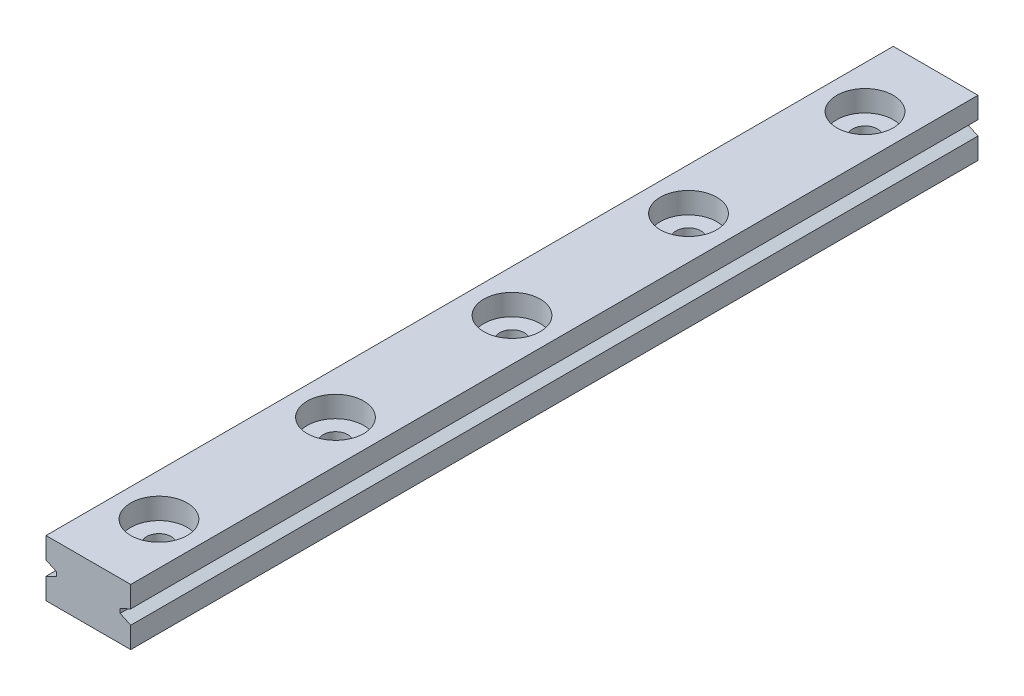
ISO-10303-21;
HEADER;
FILE_DESCRIPTION(('STEP AP214'),'2;1');
FILE_NAME('part.step','',(''),(''),'','','');
FILE_SCHEMA(('AUTOMOTIVE_DESIGN { 1 0 10303 214 1 1 1 1 }'));
ENDSEC;
DATA;
#1=APPLICATION_CONTEXT('core data for automotive mechanical design processes');
#2=APPLICATION_PROTOCOL_DEFINITION('international standard','automotive_design',2000,#1);
#3=PRODUCT_CONTEXT('',#1,'mechanical');
#4=PRODUCT('Part','Part','',(#3));
#5=PRODUCT_RELATED_PRODUCT_CATEGORY('part','',(#4));
#6=PRODUCT_DEFINITION_FORMATION('','',#4);
#7=PRODUCT_DEFINITION_CONTEXT('part definition',#1,'design');
#8=PRODUCT_DEFINITION('design','',#6,#7);
#9=PRODUCT_DEFINITION_SHAPE('','',#8);
#10=(LENGTH_UNIT() NAMED_UNIT(*) SI_UNIT(.MILLI.,.METRE.));
#11=(NAMED_UNIT(*) PLANE_ANGLE_UNIT() SI_UNIT($,.RADIAN.));
#12=(NAMED_UNIT(*) SI_UNIT($,.STERADIAN.) SOLID_ANGLE_UNIT());
#13=UNCERTAINTY_MEASURE_WITH_UNIT(LENGTH_MEASURE(1.E-05),#10,'distance_accuracy_value','');
#14=(GEOMETRIC_REPRESENTATION_CONTEXT(3) GLOBAL_UNCERTAINTY_ASSIGNED_CONTEXT((#13)) GLOBAL_UNIT_ASSIGNED_CONTEXT((#10,
#11,#12)) REPRESENTATION_CONTEXT('',''));
#15=CARTESIAN_POINT('',(0.,0.,0.));
#16=DIRECTION('',(0.,0.,1.));
#17=DIRECTION('',(1.,0.,0.));
#18=AXIS2_PLACEMENT_3D('',#15,#16,#17);
#19=CARTESIAN_POINT('',(6.,4.,120.));
#20=DIRECTION('',(-1.,0.,0.));
#21=DIRECTION('',(0.,-1.,0.));
#22=AXIS2_PLACEMENT_3D('',#19,#20,#21);
#23=PLANE('',#22);
#24=DIRECTION('',(0.,1.,0.));
#25=VECTOR('',#24,1.);
#26=CARTESIAN_POINT('',(6.,4.,120.));
#27=LINE('',#26,#25);
#28=CARTESIAN_POINT('',(6.,1.,120.));
#29=VERTEX_POINT('',#28);
#30=CARTESIAN_POINT('',(6.,4.,120.));
#31=VERTEX_POINT('',#30);
#32=EDGE_CURVE('E168',#29,#31,#27,.T.);
#33=ORIENTED_EDGE('',*,*,#32,.F.);
#34=DIRECTION('',(0.,0.,-1.));
#35=VECTOR('',#34,1.);
#36=CARTESIAN_POINT('',(6.,1.,120.));
#37=LINE('',#36,#35);
#38=CARTESIAN_POINT('',(6.,1.,0.));
#39=VERTEX_POINT('',#38);
#40=EDGE_CURVE('E217',#29,#39,#37,.T.);
#41=ORIENTED_EDGE('',*,*,#40,.T.);
#42=DIRECTION('',(0.,1.,0.));
#43=VECTOR('',#42,1.);
#44=CARTESIAN_POINT('',(6.,4.,0.));
#45=LINE('',#44,#43);
#46=CARTESIAN_POINT('',(6.,4.,0.));
#47=VERTEX_POINT('',#46);
#48=EDGE_CURVE('E162',#39,#47,#45,.T.);
#49=ORIENTED_EDGE('',*,*,#48,.T.);
#50=DIRECTION('',(0.,0.,-1.));
#51=VECTOR('',#50,1.);
#52=CARTESIAN_POINT('',(6.,4.,120.));
#53=LINE('',#52,#51);
#54=EDGE_CURVE('E11',#31,#47,#53,.T.);
#55=ORIENTED_EDGE('',*,*,#54,.F.);
#56=EDGE_LOOP('',(#33,#41,#49,#55));
#57=FACE_BOUND('',#56,.T.);
#58=ADVANCED_FACE('F34',(#57),#23,.F.);
#59=CARTESIAN_POINT('',(-6.,4.,120.));
#60=DIRECTION('',(1.,0.,0.));
#61=DIRECTION('',(0.,1.,0.));
#62=AXIS2_PLACEMENT_3D('',#59,#60,#61);
#63=PLANE('',#62);
#64=DIRECTION('',(0.,-1.,0.));
#65=VECTOR('',#64,1.);
#66=CARTESIAN_POINT('',(-6.,4.,120.));
#67=LINE('',#66,#65);
#68=CARTESIAN_POINT('',(-6.,-1.,120.));
#69=VERTEX_POINT('',#68);
#70=CARTESIAN_POINT('',(-6.,-4.,120.));
#71=VERTEX_POINT('',#70);
#72=EDGE_CURVE('E151',#69,#71,#67,.T.);
#73=ORIENTED_EDGE('',*,*,#72,.F.);
#74=DIRECTION('',(0.,0.,-1.));
#75=VECTOR('',#74,1.);
#76=CARTESIAN_POINT('',(-6.,-1.,120.));
#77=LINE('',#76,#75);
#78=CARTESIAN_POINT('',(-6.,-1.,0.));
#79=VERTEX_POINT('',#78);
#80=EDGE_CURVE('E236',#69,#79,#77,.T.);
#81=ORIENTED_EDGE('',*,*,#80,.T.);
#82=DIRECTION('',(0.,-1.,0.));
#83=VECTOR('',#82,1.);
#84=CARTESIAN_POINT('',(-6.,4.,0.));
#85=LINE('',#84,#83);
#86=CARTESIAN_POINT('',(-6.,-4.,0.));
#87=VERTEX_POINT('',#86);
#88=EDGE_CURVE('E164',#79,#87,#85,.T.);
#89=ORIENTED_EDGE('',*,*,#88,.T.);
#90=DIRECTION('',(0.,0.,-1.));
#91=VECTOR('',#90,1.);
#92=CARTESIAN_POINT('',(-6.,-4.,120.));
#93=LINE('',#92,#91);
#94=EDGE_CURVE('E171',#71,#87,#93,.T.);
#95=ORIENTED_EDGE('',*,*,#94,.F.);
#96=EDGE_LOOP('',(#73,#81,#89,#95));
#97=FACE_BOUND('',#96,.T.);
#98=ADVANCED_FACE('F323',(#97),#63,.F.);
#99=CARTESIAN_POINT('',(1.04866904845209E-12,-4.,110.));
#100=DIRECTION('',(0.,1.,0.));
#101=DIRECTION('',(0.,0.,1.));
#102=AXIS2_PLACEMENT_3D('',#99,#100,#101);
#103=CYLINDRICAL_SURFACE('',#102,1.75);
#104=CARTESIAN_POINT('',(1.04866904845209E-12,-4.,110.));
#105=DIRECTION('',(0.,1.,0.));
#106=DIRECTION('',(0.,0.,1.));
#107=AXIS2_PLACEMENT_3D('',#104,#105,#106);
#108=CIRCLE('',#107,1.75);
#109=CARTESIAN_POINT('',(1.04866904845209E-12,-4.,111.75));
#110=VERTEX_POINT('',#109);
#111=EDGE_CURVE('E189',#110,#110,#108,.T.);
#112=ORIENTED_EDGE('',*,*,#111,.F.);
#113=EDGE_LOOP('',(#112));
#114=FACE_BOUND('',#113,.T.);
#115=CARTESIAN_POINT('',(1.04866904845209E-12,1.,110.));
#116=DIRECTION('',(0.,1.,0.));
#117=DIRECTION('',(0.,0.,1.));
#118=AXIS2_PLACEMENT_3D('',#115,#116,#117);
#119=CIRCLE('',#118,1.75);
#120=CARTESIAN_POINT('',(1.04866904845209E-12,1.,111.75));
#121=VERTEX_POINT('',#120);
#122=EDGE_CURVE('E38',#121,#121,#119,.F.);
#123=ORIENTED_EDGE('',*,*,#122,.F.);
#124=EDGE_LOOP('',(#123));
#125=FACE_BOUND('',#124,.T.);
#126=ADVANCED_FACE('F327',(#114,#125),#103,.F.);
#127=CARTESIAN_POINT('',(7.86807948038852E-13,-4.,85.));
#128=DIRECTION('',(0.,1.,0.));
#129=DIRECTION('',(0.,0.,1.));
#130=AXIS2_PLACEMENT_3D('',#127,#128,#129);
#131=CYLINDRICAL_SURFACE('',#130,1.75);
#132=CARTESIAN_POINT('',(7.86807948038852E-13,-4.,85.));
#133=DIRECTION('',(0.,1.,0.));
#134=DIRECTION('',(0.,0.,1.));
#135=AXIS2_PLACEMENT_3D('',#132,#133,#134);
#136=CIRCLE('',#135,1.75);
#137=CARTESIAN_POINT('',(7.86807948038852E-13,-4.,86.75));
#138=VERTEX_POINT('',#137);
#139=EDGE_CURVE('E193',#138,#138,#136,.T.);
#140=ORIENTED_EDGE('',*,*,#139,.F.);
#141=EDGE_LOOP('',(#140));
#142=FACE_BOUND('',#141,.T.);
#143=CARTESIAN_POINT('',(7.86807948038852E-13,1.,85.));
#144=DIRECTION('',(0.,1.,0.));
#145=DIRECTION('',(0.,0.,1.));
#146=AXIS2_PLACEMENT_3D('',#143,#144,#145);
#147=CIRCLE('',#146,1.75);
#148=CARTESIAN_POINT('',(7.86807948038852E-13,1.,86.75));
#149=VERTEX_POINT('',#148);
#150=EDGE_CURVE('E184',#149,#149,#147,.F.);
#151=ORIENTED_EDGE('',*,*,#150,.F.);
#152=EDGE_LOOP('',(#151));
#153=FACE_BOUND('',#152,.T.);
#154=ADVANCED_FACE('F301',(#142,#153),#131,.F.);
#155=CARTESIAN_POINT('',(5.24946847625617E-13,-4.,60.));
#156=DIRECTION('',(0.,1.,0.));
#157=DIRECTION('',(0.,0.,1.));
#158=AXIS2_PLACEMENT_3D('',#155,#156,#157);
#159=CYLINDRICAL_SURFACE('',#158,1.75);
#160=CARTESIAN_POINT('',(5.24946847625617E-13,-4.,60.));
#161=DIRECTION('',(0.,1.,0.));
#162=DIRECTION('',(0.,0.,1.));
#163=AXIS2_PLACEMENT_3D('',#160,#161,#162);
#164=CIRCLE('',#163,1.75);
#165=CARTESIAN_POINT('',(5.24946847625617E-13,-4.,61.75));
#166=VERTEX_POINT('',#165);
#167=EDGE_CURVE('E198',#166,#166,#164,.T.);
#168=ORIENTED_EDGE('',*,*,#167,.F.);
#169=EDGE_LOOP('',(#168));
#170=FACE_BOUND('',#169,.T.);
#171=CARTESIAN_POINT('',(5.24946847625617E-13,1.,60.));
#172=DIRECTION('',(0.,1.,0.));
#173=DIRECTION('',(0.,0.,1.));
#174=AXIS2_PLACEMENT_3D('',#171,#172,#173);
#175=CIRCLE('',#174,1.75);
#176=CARTESIAN_POINT('',(5.24946847625617E-13,1.,61.75));
#177=VERTEX_POINT('',#176);
#178=EDGE_CURVE('E182',#177,#177,#175,.F.);
#179=ORIENTED_EDGE('',*,*,#178,.F.);
#180=EDGE_LOOP('',(#179));
#181=FACE_BOUND('',#180,.T.);
#182=ADVANCED_FACE('F297',(#170,#181),#159,.F.);
#183=CARTESIAN_POINT('',(2.63085747212382E-13,-4.,35.));
#184=DIRECTION('',(0.,1.,0.));
#185=DIRECTION('',(0.,0.,1.));
#186=AXIS2_PLACEMENT_3D('',#183,#184,#185);
#187=CYLINDRICAL_SURFACE('',#186,1.75);
#188=CARTESIAN_POINT('',(2.63085747212382E-13,-4.,35.));
#189=DIRECTION('',(0.,1.,0.));
#190=DIRECTION('',(0.,0.,1.));
#191=AXIS2_PLACEMENT_3D('',#188,#189,#190);
#192=CIRCLE('',#191,1.75);
#193=CARTESIAN_POINT('',(2.63085747212382E-13,-4.,36.75));
#194=VERTEX_POINT('',#193);
#195=EDGE_CURVE('E289',#194,#194,#192,.T.);
#196=ORIENTED_EDGE('',*,*,#195,.F.);
#197=EDGE_LOOP('',(#196));
#198=FACE_BOUND('',#197,.T.);
#199=CARTESIAN_POINT('',(2.63085747212382E-13,1.,35.));
#200=DIRECTION('',(0.,1.,0.));
#201=DIRECTION('',(0.,0.,1.));
#202=AXIS2_PLACEMENT_3D('',#199,#200,#201);
#203=CIRCLE('',#202,1.75);
#204=CARTESIAN_POINT('',(2.63085747212382E-13,1.,36.75));
#205=VERTEX_POINT('',#204);
#206=EDGE_CURVE('E178',#205,#205,#203,.F.);
#207=ORIENTED_EDGE('',*,*,#206,.F.);
#208=EDGE_LOOP('',(#207));
#209=FACE_BOUND('',#208,.T.);
#210=ADVANCED_FACE('F300',(#198,#209),#187,.F.);
#211=CARTESIAN_POINT('',(0.,-4.,10.));
#212=DIRECTION('',(0.,1.,0.));
#213=DIRECTION('',(0.,0.,1.));
#214=AXIS2_PLACEMENT_3D('',#211,#212,#213);
#215=CYLINDRICAL_SURFACE('',#214,1.75);
#216=CARTESIAN_POINT('',(0.,-4.,10.));
#217=DIRECTION('',(0.,1.,0.));
#218=DIRECTION('',(0.,0.,1.));
#219=AXIS2_PLACEMENT_3D('',#216,#217,#218);
#220=CIRCLE('',#219,1.75);
#221=CARTESIAN_POINT('',(0.,-4.,11.75));
#222=VERTEX_POINT('',#221);
#223=EDGE_CURVE('E220',#222,#222,#220,.T.);
#224=ORIENTED_EDGE('',*,*,#223,.F.);
#225=EDGE_LOOP('',(#224));
#226=FACE_BOUND('',#225,.T.);
#227=CARTESIAN_POINT('',(0.,1.,10.));
#228=DIRECTION('',(0.,1.,0.));
#229=DIRECTION('',(0.,0.,1.));
#230=AXIS2_PLACEMENT_3D('',#227,#228,#229);
#231=CIRCLE('',#230,1.75);
#232=CARTESIAN_POINT('',(0.,1.,11.75));
#233=VERTEX_POINT('',#232);
#234=EDGE_CURVE('E175',#233,#233,#231,.F.);
#235=ORIENTED_EDGE('',*,*,#234,.F.);
#236=EDGE_LOOP('',(#235));
#237=FACE_BOUND('',#236,.T.);
#238=ADVANCED_FACE('F331',(#226,#237),#215,.F.);
#239=CARTESIAN_POINT('',(6.,-4.,0.));
#240=VERTEX_POINT('',#239);
#241=CARTESIAN_POINT('',(6.,-1.,0.));
#242=VERTEX_POINT('',#241);
#243=EDGE_CURVE('E158',#240,#242,#45,.T.);
#244=ORIENTED_EDGE('',*,*,#243,.T.);
#245=DIRECTION('',(0.,0.,-1.));
#246=VECTOR('',#245,1.);
#247=CARTESIAN_POINT('',(6.,-1.,120.));
#248=LINE('',#247,#246);
#249=CARTESIAN_POINT('',(6.,-1.,120.));
#250=VERTEX_POINT('',#249);
#251=EDGE_CURVE('E59',#250,#242,#248,.T.);
#252=ORIENTED_EDGE('',*,*,#251,.F.);
#253=CARTESIAN_POINT('',(6.,-4.,120.));
#254=VERTEX_POINT('',#253);
#255=EDGE_CURVE('E201',#254,#250,#27,.T.);
#256=ORIENTED_EDGE('',*,*,#255,.F.);
#257=DIRECTION('',(0.,0.,-1.));
#258=VECTOR('',#257,1.);
#259=CARTESIAN_POINT('',(6.,-4.,120.));
#260=LINE('',#259,#258);
#261=EDGE_CURVE('E153',#254,#240,#260,.T.);
#262=ORIENTED_EDGE('',*,*,#261,.T.);
#263=EDGE_LOOP('',(#244,#252,#256,#262));
#264=FACE_BOUND('',#263,.T.);
#265=ADVANCED_FACE('F36',(#264),#23,.F.);
#266=CARTESIAN_POINT('',(-6.,4.,120.));
#267=DIRECTION('',(0.,-1.,0.));
#268=DIRECTION('',(0.,0.,-1.));
#269=AXIS2_PLACEMENT_3D('',#266,#267,#268);
#270=PLANE('',#269);
#271=CARTESIAN_POINT('',(0.,4.,10.));
#272=DIRECTION('',(0.,1.,0.));
#273=DIRECTION('',(0.,0.,1.));
#274=AXIS2_PLACEMENT_3D('',#271,#272,#273);
#275=CIRCLE('',#274,4.);
#276=CARTESIAN_POINT('',(0.,4.,14.));
#277=VERTEX_POINT('',#276);
#278=EDGE_CURVE('E261',#277,#277,#275,.T.);
#279=ORIENTED_EDGE('',*,*,#278,.F.);
#280=EDGE_LOOP('',(#279));
#281=FACE_BOUND('',#280,.T.);
#282=CARTESIAN_POINT('',(1.04866904845209E-12,4.,110.));
#283=DIRECTION('',(0.,1.,0.));
#284=DIRECTION('',(0.,0.,1.));
#285=AXIS2_PLACEMENT_3D('',#282,#283,#284);
#286=CIRCLE('',#285,4.);
#287=CARTESIAN_POINT('',(1.04866904845209E-12,4.,114.));
#288=VERTEX_POINT('',#287);
#289=EDGE_CURVE('E239',#288,#288,#286,.T.);
#290=ORIENTED_EDGE('',*,*,#289,.F.);
#291=EDGE_LOOP('',(#290));
#292=FACE_BOUND('',#291,.T.);
#293=CARTESIAN_POINT('',(2.63085747212382E-13,4.,35.));
#294=DIRECTION('',(0.,1.,0.));
#295=DIRECTION('',(0.,0.,1.));
#296=AXIS2_PLACEMENT_3D('',#293,#294,#295);
#297=CIRCLE('',#296,4.);
#298=CARTESIAN_POINT('',(2.63085747212382E-13,4.,39.));
#299=VERTEX_POINT('',#298);
#300=EDGE_CURVE('E274',#299,#299,#297,.T.);
#301=ORIENTED_EDGE('',*,*,#300,.F.);
#302=EDGE_LOOP('',(#301));
#303=FACE_BOUND('',#302,.T.);
#304=CARTESIAN_POINT('',(5.24946847625617E-13,4.,60.));
#305=DIRECTION('',(0.,1.,0.));
#306=DIRECTION('',(0.,0.,1.));
#307=AXIS2_PLACEMENT_3D('',#304,#305,#306);
#308=CIRCLE('',#307,4.);
#309=CARTESIAN_POINT('',(5.24946847625617E-13,4.,64.));
#310=VERTEX_POINT('',#309);
#311=EDGE_CURVE('E275',#310,#310,#308,.T.);
#312=ORIENTED_EDGE('',*,*,#311,.F.);
#313=EDGE_LOOP('',(#312));
#314=FACE_BOUND('',#313,.T.);
#315=CARTESIAN_POINT('',(7.86807948038852E-13,4.,85.));
#316=DIRECTION('',(0.,1.,0.));
#317=DIRECTION('',(0.,0.,1.));
#318=AXIS2_PLACEMENT_3D('',#315,#316,#317);
#319=CIRCLE('',#318,4.);
#320=CARTESIAN_POINT('',(7.86807948038852E-13,4.,89.));
#321=VERTEX_POINT('',#320);
#322=EDGE_CURVE('E268',#321,#321,#319,.T.);
#323=ORIENTED_EDGE('',*,*,#322,.F.);
#324=EDGE_LOOP('',(#323));
#325=FACE_BOUND('',#324,.T.);
#326=DIRECTION('',(-1.,0.,0.));
#327=VECTOR('',#326,1.);
#328=CARTESIAN_POINT('',(-6.,4.,0.));
#329=LINE('',#328,#327);
#330=CARTESIAN_POINT('',(-6.,4.,0.));
#331=VERTEX_POINT('',#330);
#332=EDGE_CURVE('E161',#47,#331,#329,.T.);
#333=ORIENTED_EDGE('',*,*,#332,.T.);
#334=DIRECTION('',(0.,0.,-1.));
#335=VECTOR('',#334,1.);
#336=CARTESIAN_POINT('',(-6.,4.,120.));
#337=LINE('',#336,#335);
#338=CARTESIAN_POINT('',(-6.,4.,120.));
#339=VERTEX_POINT('',#338);
#340=EDGE_CURVE('E43',#339,#331,#337,.T.);
#341=ORIENTED_EDGE('',*,*,#340,.F.);
#342=DIRECTION('',(-1.,0.,0.));
#343=VECTOR('',#342,1.);
#344=CARTESIAN_POINT('',(-6.,4.,120.));
#345=LINE('',#344,#343);
#346=EDGE_CURVE('E148',#31,#339,#345,.T.);
#347=ORIENTED_EDGE('',*,*,#346,.F.);
#348=ORIENTED_EDGE('',*,*,#54,.T.);
#349=EDGE_LOOP('',(#333,#341,#347,#348));
#350=FACE_BOUND('',#349,.T.);
#351=ADVANCED_FACE('F214',(#281,#292,#303,#314,#325,#350),#270,.F.);
#352=CARTESIAN_POINT('',(-6.,1.,0.));
#353=VERTEX_POINT('',#352);
#354=EDGE_CURVE('E142',#331,#353,#85,.T.);
#355=ORIENTED_EDGE('',*,*,#354,.T.);
#356=DIRECTION('',(0.,0.,-1.));
#357=VECTOR('',#356,1.);
#358=CARTESIAN_POINT('',(-6.,1.,120.));
#359=LINE('',#358,#357);
#360=CARTESIAN_POINT('',(-6.,1.,120.));
#361=VERTEX_POINT('',#360);
#362=EDGE_CURVE('E51',#361,#353,#359,.T.);
#363=ORIENTED_EDGE('',*,*,#362,.F.);
#364=EDGE_CURVE('E140',#339,#361,#67,.T.);
#365=ORIENTED_EDGE('',*,*,#364,.F.);
#366=ORIENTED_EDGE('',*,*,#340,.T.);
#367=EDGE_LOOP('',(#355,#363,#365,#366));
#368=FACE_BOUND('',#367,.T.);
#369=ADVANCED_FACE('F138',(#368),#63,.F.);
#370=CARTESIAN_POINT('',(-6.,-4.,120.));
#371=DIRECTION('',(0.,1.,0.));
#372=DIRECTION('',(0.,0.,1.));
#373=AXIS2_PLACEMENT_3D('',#370,#371,#372);
#374=PLANE('',#373);
#375=ORIENTED_EDGE('',*,*,#223,.T.);
#376=EDGE_LOOP('',(#375));
#377=FACE_BOUND('',#376,.T.);
#378=ORIENTED_EDGE('',*,*,#195,.T.);
#379=EDGE_LOOP('',(#378));
#380=FACE_BOUND('',#379,.T.);
#381=ORIENTED_EDGE('',*,*,#167,.T.);
#382=EDGE_LOOP('',(#381));
#383=FACE_BOUND('',#382,.T.);
#384=ORIENTED_EDGE('',*,*,#139,.T.);
#385=EDGE_LOOP('',(#384));
#386=FACE_BOUND('',#385,.T.);
#387=ORIENTED_EDGE('',*,*,#111,.T.);
#388=EDGE_LOOP('',(#387));
#389=FACE_BOUND('',#388,.T.);
#390=DIRECTION('',(1.,0.,0.));
#391=VECTOR('',#390,1.);
#392=CARTESIAN_POINT('',(-6.,-4.,0.));
#393=LINE('',#392,#391);
#394=EDGE_CURVE('E166',#87,#240,#393,.T.);
#395=ORIENTED_EDGE('',*,*,#394,.T.);
#396=ORIENTED_EDGE('',*,*,#261,.F.);
#397=DIRECTION('',(1.,0.,0.));
#398=VECTOR('',#397,1.);
#399=CARTESIAN_POINT('',(-6.,-4.,120.));
#400=LINE('',#399,#398);
#401=EDGE_CURVE('E150',#71,#254,#400,.T.);
#402=ORIENTED_EDGE('',*,*,#401,.F.);
#403=ORIENTED_EDGE('',*,*,#94,.T.);
#404=EDGE_LOOP('',(#395,#396,#402,#403));
#405=FACE_BOUND('',#404,.T.);
#406=ADVANCED_FACE('F294',(#377,#380,#383,#386,#389,#405),#374,.F.);
#407=CARTESIAN_POINT('',(0.,0.,120.));
#408=DIRECTION('',(0.,0.,1.));
#409=DIRECTION('',(1.,0.,0.));
#410=AXIS2_PLACEMENT_3D('',#407,#408,#409);
#411=PLANE('',#410);
#412=DIRECTION('',(-0.906183139995265,-0.422885465331124,0.));
#413=VECTOR('',#412,1.);
#414=CARTESIAN_POINT('',(-4.5,-0.3,120.));
#415=LINE('',#414,#413);
#416=CARTESIAN_POINT('',(-4.5,-0.3,120.));
#417=VERTEX_POINT('',#416);
#418=EDGE_CURVE('E143',#417,#69,#415,.T.);
#419=ORIENTED_EDGE('',*,*,#418,.T.);
#420=ORIENTED_EDGE('',*,*,#72,.T.);
#421=ORIENTED_EDGE('',*,*,#401,.T.);
#422=ORIENTED_EDGE('',*,*,#255,.T.);
#423=DIRECTION('',(-0.906183139995265,0.422885465331124,0.));
#424=VECTOR('',#423,1.);
#425=CARTESIAN_POINT('',(4.5,-0.300000000000001,120.));
#426=LINE('',#425,#424);
#427=CARTESIAN_POINT('',(4.5,-0.300000000000001,120.));
#428=VERTEX_POINT('',#427);
#429=EDGE_CURVE('E243',#250,#428,#426,.T.);
#430=ORIENTED_EDGE('',*,*,#429,.T.);
#431=DIRECTION('',(0.,1.,0.));
#432=VECTOR('',#431,1.);
#433=CARTESIAN_POINT('',(4.5,0.300000000000001,120.));
#434=LINE('',#433,#432);
#435=CARTESIAN_POINT('',(4.5,0.300000000000001,120.));
#436=VERTEX_POINT('',#435);
#437=EDGE_CURVE('E245',#428,#436,#434,.T.);
#438=ORIENTED_EDGE('',*,*,#437,.T.);
#439=DIRECTION('',(0.906183139995265,0.422885465331124,0.));
#440=VECTOR('',#439,1.);
#441=CARTESIAN_POINT('',(6.,1.,120.));
#442=LINE('',#441,#440);
#443=EDGE_CURVE('E209',#436,#29,#442,.T.);
#444=ORIENTED_EDGE('',*,*,#443,.T.);
#445=ORIENTED_EDGE('',*,*,#32,.T.);
#446=ORIENTED_EDGE('',*,*,#346,.T.);
#447=ORIENTED_EDGE('',*,*,#364,.T.);
#448=DIRECTION('',(0.906183139995265,-0.422885465331124,0.));
#449=VECTOR('',#448,1.);
#450=CARTESIAN_POINT('',(-6.,1.,120.));
#451=LINE('',#450,#449);
#452=CARTESIAN_POINT('',(-4.5,0.3,120.));
#453=VERTEX_POINT('',#452);
#454=EDGE_CURVE('E125',#361,#453,#451,.T.);
#455=ORIENTED_EDGE('',*,*,#454,.T.);
#456=DIRECTION('',(0.,-1.,0.));
#457=VECTOR('',#456,1.);
#458=CARTESIAN_POINT('',(-4.5,0.3,120.));
#459=LINE('',#458,#457);
#460=EDGE_CURVE('E132',#453,#417,#459,.T.);
#461=ORIENTED_EDGE('',*,*,#460,.T.);
#462=EDGE_LOOP('',(#419,#420,#421,#422,#430,#438,#444,#445,#446,#447,#455,#461));
#463=FACE_BOUND('',#462,.T.);
#464=ADVANCED_FACE('F146',(#463),#411,.T.);
#465=CARTESIAN_POINT('',(0.,0.,0.));
#466=DIRECTION('',(0.,0.,1.));
#467=DIRECTION('',(1.,0.,0.));
#468=AXIS2_PLACEMENT_3D('',#465,#466,#467);
#469=PLANE('',#468);
#470=ORIENTED_EDGE('',*,*,#88,.F.);
#471=DIRECTION('',(-0.906183139995265,-0.422885465331124,0.));
#472=VECTOR('',#471,1.);
#473=CARTESIAN_POINT('',(-4.5,-0.3,0.));
#474=LINE('',#473,#472);
#475=CARTESIAN_POINT('',(-4.5,-0.3,0.));
#476=VERTEX_POINT('',#475);
#477=EDGE_CURVE('E133',#476,#79,#474,.T.);
#478=ORIENTED_EDGE('',*,*,#477,.F.);
#479=DIRECTION('',(0.,-1.,0.));
#480=VECTOR('',#479,1.);
#481=CARTESIAN_POINT('',(-4.5,0.3,0.));
#482=LINE('',#481,#480);
#483=CARTESIAN_POINT('',(-4.5,0.3,0.));
#484=VERTEX_POINT('',#483);
#485=EDGE_CURVE('E227',#484,#476,#482,.T.);
#486=ORIENTED_EDGE('',*,*,#485,.F.);
#487=DIRECTION('',(0.906183139995265,-0.422885465331124,0.));
#488=VECTOR('',#487,1.);
#489=CARTESIAN_POINT('',(-6.,1.,0.));
#490=LINE('',#489,#488);
#491=EDGE_CURVE('E224',#353,#484,#490,.T.);
#492=ORIENTED_EDGE('',*,*,#491,.F.);
#493=ORIENTED_EDGE('',*,*,#354,.F.);
#494=ORIENTED_EDGE('',*,*,#332,.F.);
#495=ORIENTED_EDGE('',*,*,#48,.F.);
#496=DIRECTION('',(0.906183139995265,0.422885465331124,0.));
#497=VECTOR('',#496,1.);
#498=CARTESIAN_POINT('',(6.,1.,0.));
#499=LINE('',#498,#497);
#500=CARTESIAN_POINT('',(4.5,0.300000000000001,0.));
#501=VERTEX_POINT('',#500);
#502=EDGE_CURVE('E246',#501,#39,#499,.T.);
#503=ORIENTED_EDGE('',*,*,#502,.F.);
#504=DIRECTION('',(0.,1.,0.));
#505=VECTOR('',#504,1.);
#506=CARTESIAN_POINT('',(4.5,0.300000000000001,0.));
#507=LINE('',#506,#505);
#508=CARTESIAN_POINT('',(4.5,-0.300000000000001,0.));
#509=VERTEX_POINT('',#508);
#510=EDGE_CURVE('E251',#509,#501,#507,.T.);
#511=ORIENTED_EDGE('',*,*,#510,.F.);
#512=DIRECTION('',(-0.906183139995265,0.422885465331124,0.));
#513=VECTOR('',#512,1.);
#514=CARTESIAN_POINT('',(4.5,-0.300000000000001,0.));
#515=LINE('',#514,#513);
#516=EDGE_CURVE('E249',#242,#509,#515,.T.);
#517=ORIENTED_EDGE('',*,*,#516,.F.);
#518=ORIENTED_EDGE('',*,*,#243,.F.);
#519=ORIENTED_EDGE('',*,*,#394,.F.);
#520=EDGE_LOOP('',(#470,#478,#486,#492,#493,#494,#495,#503,#511,#517,#518,#519));
#521=FACE_BOUND('',#520,.T.);
#522=ADVANCED_FACE('F222',(#521),#469,.F.);
#523=CARTESIAN_POINT('',(0.,1.,10.));
#524=DIRECTION('',(0.,1.,0.));
#525=DIRECTION('',(0.,0.,1.));
#526=AXIS2_PLACEMENT_3D('',#523,#524,#525);
#527=PLANE('',#526);
#528=CARTESIAN_POINT('',(0.,1.,10.));
#529=DIRECTION('',(0.,1.,0.));
#530=DIRECTION('',(0.,0.,1.));
#531=AXIS2_PLACEMENT_3D('',#528,#529,#530);
#532=CIRCLE('',#531,4.);
#533=CARTESIAN_POINT('',(0.,1.,14.));
#534=VERTEX_POINT('',#533);
#535=EDGE_CURVE('E179',#534,#534,#532,.T.);
#536=ORIENTED_EDGE('',*,*,#535,.T.);
#537=EDGE_LOOP('',(#536));
#538=FACE_BOUND('',#537,.T.);
#539=ORIENTED_EDGE('',*,*,#234,.T.);
#540=EDGE_LOOP('',(#539));
#541=FACE_BOUND('',#540,.T.);
#542=ADVANCED_FACE('F366',(#538,#541),#527,.T.);
#543=CARTESIAN_POINT('',(0.,1.,10.));
#544=DIRECTION('',(0.,1.,0.));
#545=DIRECTION('',(0.,0.,1.));
#546=AXIS2_PLACEMENT_3D('',#543,#544,#545);
#547=CYLINDRICAL_SURFACE('',#546,4.);
#548=ORIENTED_EDGE('',*,*,#535,.F.);
#549=EDGE_LOOP('',(#548));
#550=FACE_BOUND('',#549,.T.);
#551=ORIENTED_EDGE('',*,*,#278,.T.);
#552=EDGE_LOOP('',(#551));
#553=FACE_BOUND('',#552,.T.);
#554=ADVANCED_FACE('F369',(#550,#553),#547,.F.);
#555=CARTESIAN_POINT('',(2.63085747212382E-13,1.,35.));
#556=DIRECTION('',(0.,1.,0.));
#557=DIRECTION('',(0.,0.,1.));
#558=AXIS2_PLACEMENT_3D('',#555,#556,#557);
#559=PLANE('',#558);
#560=CARTESIAN_POINT('',(2.63085747212382E-13,1.,35.));
#561=DIRECTION('',(0.,1.,0.));
#562=DIRECTION('',(0.,0.,1.));
#563=AXIS2_PLACEMENT_3D('',#560,#561,#562);
#564=CIRCLE('',#563,4.);
#565=CARTESIAN_POINT('',(2.63085747212382E-13,1.,39.));
#566=VERTEX_POINT('',#565);
#567=EDGE_CURVE('E264',#566,#566,#564,.T.);
#568=ORIENTED_EDGE('',*,*,#567,.T.);
#569=EDGE_LOOP('',(#568));
#570=FACE_BOUND('',#569,.T.);
#571=ORIENTED_EDGE('',*,*,#206,.T.);
#572=EDGE_LOOP('',(#571));
#573=FACE_BOUND('',#572,.T.);
#574=ADVANCED_FACE('F318',(#570,#573),#559,.T.);
#575=CARTESIAN_POINT('',(2.63085747212382E-13,1.,35.));
#576=DIRECTION('',(0.,1.,0.));
#577=DIRECTION('',(0.,0.,1.));
#578=AXIS2_PLACEMENT_3D('',#575,#576,#577);
#579=CYLINDRICAL_SURFACE('',#578,4.);
#580=ORIENTED_EDGE('',*,*,#567,.F.);
#581=EDGE_LOOP('',(#580));
#582=FACE_BOUND('',#581,.T.);
#583=ORIENTED_EDGE('',*,*,#300,.T.);
#584=EDGE_LOOP('',(#583));
#585=FACE_BOUND('',#584,.T.);
#586=ADVANCED_FACE('F308',(#582,#585),#579,.F.);
#587=CARTESIAN_POINT('',(5.24946847625617E-13,1.,60.));
#588=DIRECTION('',(0.,1.,0.));
#589=DIRECTION('',(0.,0.,1.));
#590=AXIS2_PLACEMENT_3D('',#587,#588,#589);
#591=PLANE('',#590);
#592=CARTESIAN_POINT('',(5.24946847625617E-13,1.,60.));
#593=DIRECTION('',(0.,1.,0.));
#594=DIRECTION('',(0.,0.,1.));
#595=AXIS2_PLACEMENT_3D('',#592,#593,#594);
#596=CIRCLE('',#595,4.);
#597=CARTESIAN_POINT('',(5.24946847625617E-13,1.,64.));
#598=VERTEX_POINT('',#597);
#599=EDGE_CURVE('E271',#598,#598,#596,.T.);
#600=ORIENTED_EDGE('',*,*,#599,.T.);
#601=EDGE_LOOP('',(#600));
#602=FACE_BOUND('',#601,.T.);
#603=ORIENTED_EDGE('',*,*,#178,.T.);
#604=EDGE_LOOP('',(#603));
#605=FACE_BOUND('',#604,.T.);
#606=ADVANCED_FACE('F305',(#602,#605),#591,.T.);
#607=CARTESIAN_POINT('',(5.24946847625617E-13,1.,60.));
#608=DIRECTION('',(0.,1.,0.));
#609=DIRECTION('',(0.,0.,1.));
#610=AXIS2_PLACEMENT_3D('',#607,#608,#609);
#611=CYLINDRICAL_SURFACE('',#610,4.);
#612=ORIENTED_EDGE('',*,*,#599,.F.);
#613=EDGE_LOOP('',(#612));
#614=FACE_BOUND('',#613,.T.);
#615=ORIENTED_EDGE('',*,*,#311,.T.);
#616=EDGE_LOOP('',(#615));
#617=FACE_BOUND('',#616,.T.);
#618=ADVANCED_FACE('F307',(#614,#617),#611,.F.);
#619=CARTESIAN_POINT('',(7.86807948038852E-13,1.,85.));
#620=DIRECTION('',(0.,1.,0.));
#621=DIRECTION('',(0.,0.,1.));
#622=AXIS2_PLACEMENT_3D('',#619,#620,#621);
#623=PLANE('',#622);
#624=CARTESIAN_POINT('',(7.86807948038852E-13,1.,85.));
#625=DIRECTION('',(0.,1.,0.));
#626=DIRECTION('',(0.,0.,1.));
#627=AXIS2_PLACEMENT_3D('',#624,#625,#626);
#628=CIRCLE('',#627,4.);
#629=CARTESIAN_POINT('',(7.86807948038852E-13,1.,89.));
#630=VERTEX_POINT('',#629);
#631=EDGE_CURVE('E278',#630,#630,#628,.T.);
#632=ORIENTED_EDGE('',*,*,#631,.T.);
#633=EDGE_LOOP('',(#632));
#634=FACE_BOUND('',#633,.T.);
#635=ORIENTED_EDGE('',*,*,#150,.T.);
#636=EDGE_LOOP('',(#635));
#637=FACE_BOUND('',#636,.T.);
#638=ADVANCED_FACE('F315',(#634,#637),#623,.T.);
#639=CARTESIAN_POINT('',(7.86807948038852E-13,1.,85.));
#640=DIRECTION('',(0.,1.,0.));
#641=DIRECTION('',(0.,0.,1.));
#642=AXIS2_PLACEMENT_3D('',#639,#640,#641);
#643=CYLINDRICAL_SURFACE('',#642,4.);
#644=ORIENTED_EDGE('',*,*,#631,.F.);
#645=EDGE_LOOP('',(#644));
#646=FACE_BOUND('',#645,.T.);
#647=ORIENTED_EDGE('',*,*,#322,.T.);
#648=EDGE_LOOP('',(#647));
#649=FACE_BOUND('',#648,.T.);
#650=ADVANCED_FACE('F375',(#646,#649),#643,.F.);
#651=CARTESIAN_POINT('',(1.04866904845209E-12,1.,110.));
#652=DIRECTION('',(0.,1.,0.));
#653=DIRECTION('',(0.,0.,1.));
#654=AXIS2_PLACEMENT_3D('',#651,#652,#653);
#655=PLANE('',#654);
#656=CARTESIAN_POINT('',(1.04866904845209E-12,1.,110.));
#657=DIRECTION('',(0.,1.,0.));
#658=DIRECTION('',(0.,0.,1.));
#659=AXIS2_PLACEMENT_3D('',#656,#657,#658);
#660=CIRCLE('',#659,4.);
#661=CARTESIAN_POINT('',(1.04866904845209E-12,1.,114.));
#662=VERTEX_POINT('',#661);
#663=EDGE_CURVE('E265',#662,#662,#660,.T.);
#664=ORIENTED_EDGE('',*,*,#663,.T.);
#665=EDGE_LOOP('',(#664));
#666=FACE_BOUND('',#665,.T.);
#667=ORIENTED_EDGE('',*,*,#122,.T.);
#668=EDGE_LOOP('',(#667));
#669=FACE_BOUND('',#668,.T.);
#670=ADVANCED_FACE('F358',(#666,#669),#655,.T.);
#671=CARTESIAN_POINT('',(1.04866904845209E-12,1.,110.));
#672=DIRECTION('',(0.,1.,0.));
#673=DIRECTION('',(0.,0.,1.));
#674=AXIS2_PLACEMENT_3D('',#671,#672,#673);
#675=CYLINDRICAL_SURFACE('',#674,4.);
#676=ORIENTED_EDGE('',*,*,#663,.F.);
#677=EDGE_LOOP('',(#676));
#678=FACE_BOUND('',#677,.T.);
#679=ORIENTED_EDGE('',*,*,#289,.T.);
#680=EDGE_LOOP('',(#679));
#681=FACE_BOUND('',#680,.T.);
#682=ADVANCED_FACE('F351',(#678,#681),#675,.F.);
#683=CARTESIAN_POINT('',(6.,1.,120.));
#684=DIRECTION('',(-0.422885465331124,0.906183139995265,0.));
#685=DIRECTION('',(-0.906183139995266,-0.422885465331124,0.));
#686=AXIS2_PLACEMENT_3D('',#683,#684,#685);
#687=PLANE('',#686);
#688=ORIENTED_EDGE('',*,*,#502,.T.);
#689=ORIENTED_EDGE('',*,*,#40,.F.);
#690=ORIENTED_EDGE('',*,*,#443,.F.);
#691=DIRECTION('',(0.,0.,-1.));
#692=VECTOR('',#691,1.);
#693=CARTESIAN_POINT('',(4.5,0.300000000000001,120.));
#694=LINE('',#693,#692);
#695=EDGE_CURVE('E230',#436,#501,#694,.T.);
#696=ORIENTED_EDGE('',*,*,#695,.T.);
#697=EDGE_LOOP('',(#688,#689,#690,#696));
#698=FACE_BOUND('',#697,.T.);
#699=ADVANCED_FACE('F349',(#698),#687,.F.);
#700=CARTESIAN_POINT('',(4.5,0.300000000000001,120.));
#701=DIRECTION('',(-1.,0.,0.));
#702=DIRECTION('',(0.,0.,1.));
#703=AXIS2_PLACEMENT_3D('',#700,#701,#702);
#704=PLANE('',#703);
#705=ORIENTED_EDGE('',*,*,#510,.T.);
#706=ORIENTED_EDGE('',*,*,#695,.F.);
#707=ORIENTED_EDGE('',*,*,#437,.F.);
#708=DIRECTION('',(0.,0.,-1.));
#709=VECTOR('',#708,1.);
#710=CARTESIAN_POINT('',(4.5,-0.300000000000001,120.));
#711=LINE('',#710,#709);
#712=EDGE_CURVE('E256',#428,#509,#711,.T.);
#713=ORIENTED_EDGE('',*,*,#712,.T.);
#714=EDGE_LOOP('',(#705,#706,#707,#713));
#715=FACE_BOUND('',#714,.T.);
#716=ADVANCED_FACE('F347',(#715),#704,.F.);
#717=CARTESIAN_POINT('',(4.5,-0.300000000000001,120.));
#718=DIRECTION('',(-0.422885465331124,-0.906183139995265,0.));
#719=DIRECTION('',(0.906183139995266,-0.422885465331124,0.));
#720=AXIS2_PLACEMENT_3D('',#717,#718,#719);
#721=PLANE('',#720);
#722=ORIENTED_EDGE('',*,*,#516,.T.);
#723=ORIENTED_EDGE('',*,*,#712,.F.);
#724=ORIENTED_EDGE('',*,*,#429,.F.);
#725=ORIENTED_EDGE('',*,*,#251,.T.);
#726=EDGE_LOOP('',(#722,#723,#724,#725));
#727=FACE_BOUND('',#726,.T.);
#728=ADVANCED_FACE('F344',(#727),#721,.F.);
#729=CARTESIAN_POINT('',(-4.5,-0.3,120.));
#730=DIRECTION('',(0.422885465331124,-0.906183139995265,0.));
#731=DIRECTION('',(0.906183139995265,0.422885465331124,0.));
#732=AXIS2_PLACEMENT_3D('',#729,#730,#731);
#733=PLANE('',#732);
#734=ORIENTED_EDGE('',*,*,#477,.T.);
#735=ORIENTED_EDGE('',*,*,#80,.F.);
#736=ORIENTED_EDGE('',*,*,#418,.F.);
#737=DIRECTION('',(0.,0.,-1.));
#738=VECTOR('',#737,1.);
#739=CARTESIAN_POINT('',(-4.5,-0.3,120.));
#740=LINE('',#739,#738);
#741=EDGE_CURVE('E240',#417,#476,#740,.T.);
#742=ORIENTED_EDGE('',*,*,#741,.T.);
#743=EDGE_LOOP('',(#734,#735,#736,#742));
#744=FACE_BOUND('',#743,.T.);
#745=ADVANCED_FACE('F365',(#744),#733,.F.);
#746=CARTESIAN_POINT('',(-4.5,0.3,120.));
#747=DIRECTION('',(1.,0.,0.));
#748=DIRECTION('',(0.,0.,-1.));
#749=AXIS2_PLACEMENT_3D('',#746,#747,#748);
#750=PLANE('',#749);
#751=ORIENTED_EDGE('',*,*,#485,.T.);
#752=ORIENTED_EDGE('',*,*,#741,.F.);
#753=ORIENTED_EDGE('',*,*,#460,.F.);
#754=DIRECTION('',(0.,0.,-1.));
#755=VECTOR('',#754,1.);
#756=CARTESIAN_POINT('',(-4.5,0.3,120.));
#757=LINE('',#756,#755);
#758=EDGE_CURVE('E127',#453,#484,#757,.T.);
#759=ORIENTED_EDGE('',*,*,#758,.T.);
#760=EDGE_LOOP('',(#751,#752,#753,#759));
#761=FACE_BOUND('',#760,.T.);
#762=ADVANCED_FACE('F569',(#761),#750,.F.);
#763=CARTESIAN_POINT('',(-6.,1.,120.));
#764=DIRECTION('',(0.422885465331124,0.906183139995265,0.));
#765=DIRECTION('',(-0.906183139995265,0.422885465331124,0.));
#766=AXIS2_PLACEMENT_3D('',#763,#764,#765);
#767=PLANE('',#766);
#768=ORIENTED_EDGE('',*,*,#491,.T.);
#769=ORIENTED_EDGE('',*,*,#758,.F.);
#770=ORIENTED_EDGE('',*,*,#454,.F.);
#771=ORIENTED_EDGE('',*,*,#362,.T.);
#772=EDGE_LOOP('',(#768,#769,#770,#771));
#773=FACE_BOUND('',#772,.T.);
#774=ADVANCED_FACE('F126',(#773),#767,.F.);
#775=CLOSED_SHELL('',(#58,#98,#126,#154,#182,#210,#238,#265,#351,#369,#406,#464,#522,#542,#554,
#574,#586,#606,#618,#638,#650,#670,#682,#699,#716,#728,#745,#762,#774));
#776=MANIFOLD_SOLID_BREP('B2',#775);
#777=ADVANCED_BREP_SHAPE_REPRESENTATION('',(#18,#776),#14);
#778=SHAPE_DEFINITION_REPRESENTATION(#9,#777);
ENDSEC;
END-ISO-10303-21;
